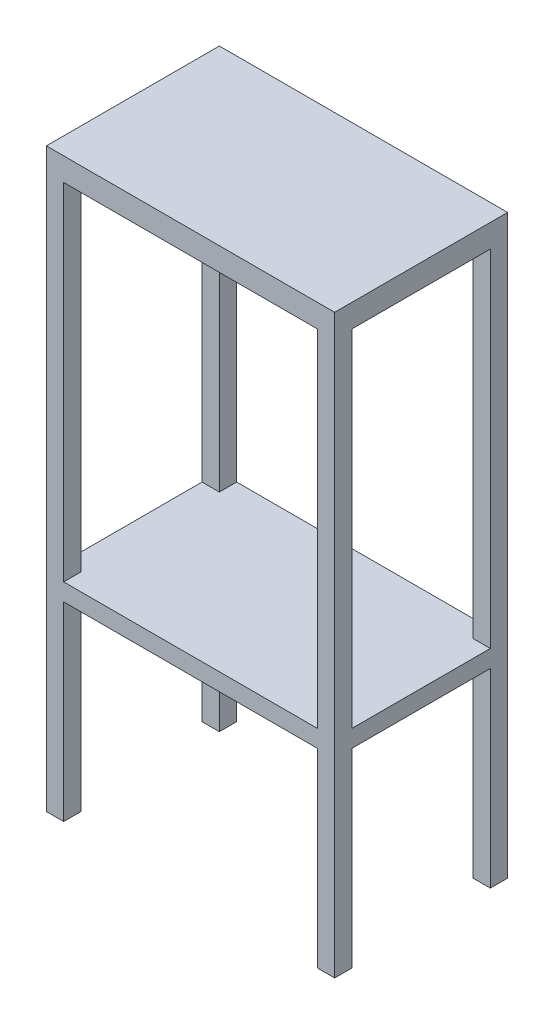
ISO-10303-21;
HEADER;
FILE_DESCRIPTION(('STEP AP214'),'2;1');
FILE_NAME('part.step','',(''),(''),'','','');
FILE_SCHEMA(('AUTOMOTIVE_DESIGN { 1 0 10303 214 1 1 1 1 }'));
ENDSEC;
DATA;
#1=APPLICATION_CONTEXT('core data for automotive mechanical design processes');
#2=APPLICATION_PROTOCOL_DEFINITION('international standard','automotive_design',2000,#1);
#3=PRODUCT_CONTEXT('',#1,'mechanical');
#4=PRODUCT('Part','Part','',(#3));
#5=PRODUCT_RELATED_PRODUCT_CATEGORY('part','',(#4));
#6=PRODUCT_DEFINITION_FORMATION('','',#4);
#7=PRODUCT_DEFINITION_CONTEXT('part definition',#1,'design');
#8=PRODUCT_DEFINITION('design','',#6,#7);
#9=PRODUCT_DEFINITION_SHAPE('','',#8);
#10=(LENGTH_UNIT() NAMED_UNIT(*) SI_UNIT(.MILLI.,.METRE.));
#11=(NAMED_UNIT(*) PLANE_ANGLE_UNIT() SI_UNIT($,.RADIAN.));
#12=(NAMED_UNIT(*) SI_UNIT($,.STERADIAN.) SOLID_ANGLE_UNIT());
#13=UNCERTAINTY_MEASURE_WITH_UNIT(LENGTH_MEASURE(1.E-05),#10,'distance_accuracy_value','');
#14=(GEOMETRIC_REPRESENTATION_CONTEXT(3) GLOBAL_UNCERTAINTY_ASSIGNED_CONTEXT((#13)) GLOBAL_UNIT_ASSIGNED_CONTEXT((#10,
#11,#12)) REPRESENTATION_CONTEXT('',''));
#15=CARTESIAN_POINT('',(0.,0.,0.));
#16=DIRECTION('',(0.,0.,1.));
#17=DIRECTION('',(1.,0.,0.));
#18=AXIS2_PLACEMENT_3D('',#15,#16,#17);
#19=CARTESIAN_POINT('',(250.,1000.,-150.));
#20=DIRECTION('',(-1.,0.,0.));
#21=DIRECTION('',(0.,0.,1.));
#22=AXIS2_PLACEMENT_3D('',#19,#20,#21);
#23=PLANE('',#22);
#24=DIRECTION('',(0.,0.,1.));
#25=VECTOR('',#24,1.);
#26=CARTESIAN_POINT('',(250.,960.,-150.));
#27=LINE('',#26,#25);
#28=CARTESIAN_POINT('',(250.,960.,-120.));
#29=VERTEX_POINT('',#28);
#30=CARTESIAN_POINT('',(250.,960.,120.));
#31=VERTEX_POINT('',#30);
#32=EDGE_CURVE('E306',#29,#31,#27,.T.);
#33=ORIENTED_EDGE('',*,*,#32,.F.);
#34=DIRECTION('',(0.,1.,0.));
#35=VECTOR('',#34,1.);
#36=CARTESIAN_POINT('',(250.,1000.,-120.));
#37=LINE('',#36,#35);
#38=CARTESIAN_POINT('',(250.,360.,-120.));
#39=VERTEX_POINT('',#38);
#40=EDGE_CURVE('E426',#39,#29,#37,.T.);
#41=ORIENTED_EDGE('',*,*,#40,.F.);
#42=DIRECTION('',(0.,0.,-1.));
#43=VECTOR('',#42,1.);
#44=CARTESIAN_POINT('',(250.,360.,-150.));
#45=LINE('',#44,#43);
#46=CARTESIAN_POINT('',(250.,360.,120.));
#47=VERTEX_POINT('',#46);
#48=EDGE_CURVE('E440',#47,#39,#45,.T.);
#49=ORIENTED_EDGE('',*,*,#48,.F.);
#50=DIRECTION('',(0.,-1.,0.));
#51=VECTOR('',#50,1.);
#52=CARTESIAN_POINT('',(250.,1000.,120.));
#53=LINE('',#52,#51);
#54=EDGE_CURVE('E436',#31,#47,#53,.T.);
#55=ORIENTED_EDGE('',*,*,#54,.F.);
#56=EDGE_LOOP('',(#33,#41,#49,#55));
#57=FACE_BOUND('',#56,.T.);
#58=DIRECTION('',(0.,1.,0.));
#59=VECTOR('',#58,1.);
#60=CARTESIAN_POINT('',(250.,1000.,-120.));
#61=LINE('',#60,#59);
#62=CARTESIAN_POINT('',(250.,0.,-120.));
#63=VERTEX_POINT('',#62);
#64=CARTESIAN_POINT('',(250.,330.,-120.));
#65=VERTEX_POINT('',#64);
#66=EDGE_CURVE('E401',#63,#65,#61,.T.);
#67=ORIENTED_EDGE('',*,*,#66,.F.);
#68=DIRECTION('',(0.,0.,-1.));
#69=VECTOR('',#68,1.);
#70=CARTESIAN_POINT('',(250.,0.,-150.));
#71=LINE('',#70,#69);
#72=CARTESIAN_POINT('',(250.,0.,-150.));
#73=VERTEX_POINT('',#72);
#74=EDGE_CURVE('E241',#63,#73,#71,.T.);
#75=ORIENTED_EDGE('',*,*,#74,.T.);
#76=DIRECTION('',(0.,-1.,0.));
#77=VECTOR('',#76,1.);
#78=CARTESIAN_POINT('',(250.,1000.,-150.));
#79=LINE('',#78,#77);
#80=CARTESIAN_POINT('',(250.,1000.,-150.));
#81=VERTEX_POINT('',#80);
#82=EDGE_CURVE('E267',#81,#73,#79,.T.);
#83=ORIENTED_EDGE('',*,*,#82,.F.);
#84=DIRECTION('',(0.,0.,-1.));
#85=VECTOR('',#84,1.);
#86=CARTESIAN_POINT('',(250.,1000.,-150.));
#87=LINE('',#86,#85);
#88=CARTESIAN_POINT('',(250.,1000.,150.));
#89=VERTEX_POINT('',#88);
#90=EDGE_CURVE('E259',#89,#81,#87,.T.);
#91=ORIENTED_EDGE('',*,*,#90,.F.);
#92=DIRECTION('',(0.,-1.,0.));
#93=VECTOR('',#92,1.);
#94=CARTESIAN_POINT('',(250.,1000.,150.));
#95=LINE('',#94,#93);
#96=CARTESIAN_POINT('',(250.,0.,150.));
#97=VERTEX_POINT('',#96);
#98=EDGE_CURVE('E239',#89,#97,#95,.T.);
#99=ORIENTED_EDGE('',*,*,#98,.T.);
#100=CARTESIAN_POINT('',(250.,0.,120.));
#101=VERTEX_POINT('',#100);
#102=EDGE_CURVE('E231',#97,#101,#71,.T.);
#103=ORIENTED_EDGE('',*,*,#102,.T.);
#104=DIRECTION('',(0.,-1.,0.));
#105=VECTOR('',#104,1.);
#106=CARTESIAN_POINT('',(250.,1000.,120.));
#107=LINE('',#106,#105);
#108=CARTESIAN_POINT('',(250.,330.,120.));
#109=VERTEX_POINT('',#108);
#110=EDGE_CURVE('E216',#109,#101,#107,.T.);
#111=ORIENTED_EDGE('',*,*,#110,.F.);
#112=DIRECTION('',(0.,0.,1.));
#113=VECTOR('',#112,1.);
#114=CARTESIAN_POINT('',(250.,330.,-150.));
#115=LINE('',#114,#113);
#116=EDGE_CURVE('E394',#65,#109,#115,.T.);
#117=ORIENTED_EDGE('',*,*,#116,.F.);
#118=EDGE_LOOP('',(#67,#75,#83,#91,#99,#103,#111,#117));
#119=FACE_BOUND('',#118,.T.);
#120=ADVANCED_FACE('F33',(#57,#119),#23,.F.);
#121=CARTESIAN_POINT('',(-250.,1000.,-150.));
#122=DIRECTION('',(1.,0.,0.));
#123=DIRECTION('',(0.,0.,-1.));
#124=AXIS2_PLACEMENT_3D('',#121,#122,#123);
#125=PLANE('',#124);
#126=DIRECTION('',(0.,0.,-1.));
#127=VECTOR('',#126,1.);
#128=CARTESIAN_POINT('',(-250.,960.,-150.));
#129=LINE('',#128,#127);
#130=CARTESIAN_POINT('',(-250.,960.,120.));
#131=VERTEX_POINT('',#130);
#132=CARTESIAN_POINT('',(-250.,960.,-120.));
#133=VERTEX_POINT('',#132);
#134=EDGE_CURVE('E442',#131,#133,#129,.T.);
#135=ORIENTED_EDGE('',*,*,#134,.F.);
#136=DIRECTION('',(0.,1.,0.));
#137=VECTOR('',#136,1.);
#138=CARTESIAN_POINT('',(-250.,1000.,120.));
#139=LINE('',#138,#137);
#140=CARTESIAN_POINT('',(-250.,360.,120.));
#141=VERTEX_POINT('',#140);
#142=EDGE_CURVE('E434',#141,#131,#139,.T.);
#143=ORIENTED_EDGE('',*,*,#142,.F.);
#144=DIRECTION('',(0.,0.,1.));
#145=VECTOR('',#144,1.);
#146=CARTESIAN_POINT('',(-250.,360.,-150.));
#147=LINE('',#146,#145);
#148=CARTESIAN_POINT('',(-250.,360.,-120.));
#149=VERTEX_POINT('',#148);
#150=EDGE_CURVE('E438',#149,#141,#147,.T.);
#151=ORIENTED_EDGE('',*,*,#150,.F.);
#152=DIRECTION('',(0.,-1.,0.));
#153=VECTOR('',#152,1.);
#154=CARTESIAN_POINT('',(-250.,1000.,-120.));
#155=LINE('',#154,#153);
#156=EDGE_CURVE('E424',#133,#149,#155,.T.);
#157=ORIENTED_EDGE('',*,*,#156,.F.);
#158=EDGE_LOOP('',(#135,#143,#151,#157));
#159=FACE_BOUND('',#158,.T.);
#160=DIRECTION('',(0.,-1.,0.));
#161=VECTOR('',#160,1.);
#162=CARTESIAN_POINT('',(-250.,1000.,-120.));
#163=LINE('',#162,#161);
#164=CARTESIAN_POINT('',(-250.,330.,-120.));
#165=VERTEX_POINT('',#164);
#166=CARTESIAN_POINT('',(-250.,0.,-120.));
#167=VERTEX_POINT('',#166);
#168=EDGE_CURVE('E399',#165,#167,#163,.T.);
#169=ORIENTED_EDGE('',*,*,#168,.F.);
#170=DIRECTION('',(0.,0.,-1.));
#171=VECTOR('',#170,1.);
#172=CARTESIAN_POINT('',(-250.,330.,-150.));
#173=LINE('',#172,#171);
#174=CARTESIAN_POINT('',(-250.,330.,120.));
#175=VERTEX_POINT('',#174);
#176=EDGE_CURVE('E223',#175,#165,#173,.T.);
#177=ORIENTED_EDGE('',*,*,#176,.F.);
#178=DIRECTION('',(0.,1.,0.));
#179=VECTOR('',#178,1.);
#180=CARTESIAN_POINT('',(-250.,1000.,120.));
#181=LINE('',#180,#179);
#182=CARTESIAN_POINT('',(-250.,0.,120.));
#183=VERTEX_POINT('',#182);
#184=EDGE_CURVE('E224',#183,#175,#181,.T.);
#185=ORIENTED_EDGE('',*,*,#184,.F.);
#186=DIRECTION('',(0.,0.,1.));
#187=VECTOR('',#186,1.);
#188=CARTESIAN_POINT('',(-250.,0.,-150.));
#189=LINE('',#188,#187);
#190=CARTESIAN_POINT('',(-250.,0.,150.));
#191=VERTEX_POINT('',#190);
#192=EDGE_CURVE('E251',#183,#191,#189,.T.);
#193=ORIENTED_EDGE('',*,*,#192,.T.);
#194=DIRECTION('',(0.,-1.,0.));
#195=VECTOR('',#194,1.);
#196=CARTESIAN_POINT('',(-250.,1000.,150.));
#197=LINE('',#196,#195);
#198=CARTESIAN_POINT('',(-250.,1000.,150.));
#199=VERTEX_POINT('',#198);
#200=EDGE_CURVE('E261',#199,#191,#197,.T.);
#201=ORIENTED_EDGE('',*,*,#200,.F.);
#202=DIRECTION('',(0.,0.,1.));
#203=VECTOR('',#202,1.);
#204=CARTESIAN_POINT('',(-250.,1000.,-150.));
#205=LINE('',#204,#203);
#206=CARTESIAN_POINT('',(-250.,1000.,-150.));
#207=VERTEX_POINT('',#206);
#208=EDGE_CURVE('E353',#207,#199,#205,.T.);
#209=ORIENTED_EDGE('',*,*,#208,.F.);
#210=DIRECTION('',(0.,-1.,0.));
#211=VECTOR('',#210,1.);
#212=CARTESIAN_POINT('',(-250.,1000.,-150.));
#213=LINE('',#212,#211);
#214=CARTESIAN_POINT('',(-250.,0.,-150.));
#215=VERTEX_POINT('',#214);
#216=EDGE_CURVE('E264',#207,#215,#213,.T.);
#217=ORIENTED_EDGE('',*,*,#216,.T.);
#218=EDGE_CURVE('E252',#215,#167,#189,.T.);
#219=ORIENTED_EDGE('',*,*,#218,.T.);
#220=EDGE_LOOP('',(#169,#177,#185,#193,#201,#209,#217,#219));
#221=FACE_BOUND('',#220,.T.);
#222=ADVANCED_FACE('F374',(#159,#221),#125,.F.);
#223=CARTESIAN_POINT('',(250.,0.,150.));
#224=DIRECTION('',(0.,1.,0.));
#225=DIRECTION('',(0.,0.,1.));
#226=AXIS2_PLACEMENT_3D('',#223,#224,#225);
#227=PLANE('',#226);
#228=DIRECTION('',(-1.,0.,0.));
#229=VECTOR('',#228,1.);
#230=CARTESIAN_POINT('',(1000.,0.,-120.));
#231=LINE('',#230,#229);
#232=CARTESIAN_POINT('',(220.,0.,-120.));
#233=VERTEX_POINT('',#232);
#234=EDGE_CURVE('E380',#63,#233,#231,.T.);
#235=ORIENTED_EDGE('',*,*,#234,.T.);
#236=DIRECTION('',(0.,0.,1.));
#237=VECTOR('',#236,1.);
#238=CARTESIAN_POINT('',(220.,0.,150.));
#239=LINE('',#238,#237);
#240=CARTESIAN_POINT('',(220.,0.,-150.));
#241=VERTEX_POINT('',#240);
#242=EDGE_CURVE('E283',#241,#233,#239,.T.);
#243=ORIENTED_EDGE('',*,*,#242,.F.);
#244=DIRECTION('',(-1.,0.,0.));
#245=VECTOR('',#244,1.);
#246=CARTESIAN_POINT('',(-250.,0.,-150.));
#247=LINE('',#246,#245);
#248=EDGE_CURVE('E243',#73,#241,#247,.T.);
#249=ORIENTED_EDGE('',*,*,#248,.F.);
#250=ORIENTED_EDGE('',*,*,#74,.F.);
#251=EDGE_LOOP('',(#235,#243,#249,#250));
#252=FACE_BOUND('',#251,.T.);
#253=ADVANCED_FACE('F514',(#252),#227,.F.);
#254=DIRECTION('',(-1.,0.,0.));
#255=VECTOR('',#254,1.);
#256=CARTESIAN_POINT('',(1000.,0.,120.));
#257=LINE('',#256,#255);
#258=CARTESIAN_POINT('',(220.,0.,120.));
#259=VERTEX_POINT('',#258);
#260=EDGE_CURVE('E47',#101,#259,#257,.T.);
#261=ORIENTED_EDGE('',*,*,#260,.F.);
#262=ORIENTED_EDGE('',*,*,#102,.F.);
#263=DIRECTION('',(1.,0.,0.));
#264=VECTOR('',#263,1.);
#265=CARTESIAN_POINT('',(-250.,0.,150.));
#266=LINE('',#265,#264);
#267=CARTESIAN_POINT('',(220.,0.,150.));
#268=VERTEX_POINT('',#267);
#269=EDGE_CURVE('E255',#268,#97,#266,.T.);
#270=ORIENTED_EDGE('',*,*,#269,.F.);
#271=EDGE_CURVE('E232',#259,#268,#239,.T.);
#272=ORIENTED_EDGE('',*,*,#271,.F.);
#273=EDGE_LOOP('',(#261,#262,#270,#272));
#274=FACE_BOUND('',#273,.T.);
#275=ADVANCED_FACE('F229',(#274),#227,.F.);
#276=CARTESIAN_POINT('',(-220.,0.,-120.));
#277=VERTEX_POINT('',#276);
#278=EDGE_CURVE('E382',#277,#167,#231,.T.);
#279=ORIENTED_EDGE('',*,*,#278,.T.);
#280=ORIENTED_EDGE('',*,*,#218,.F.);
#281=CARTESIAN_POINT('',(-220.,0.,-150.));
#282=VERTEX_POINT('',#281);
#283=EDGE_CURVE('E240',#282,#215,#247,.T.);
#284=ORIENTED_EDGE('',*,*,#283,.F.);
#285=DIRECTION('',(0.,0.,-1.));
#286=VECTOR('',#285,1.);
#287=CARTESIAN_POINT('',(-220.,0.,150.));
#288=LINE('',#287,#286);
#289=EDGE_CURVE('E279',#277,#282,#288,.T.);
#290=ORIENTED_EDGE('',*,*,#289,.F.);
#291=EDGE_LOOP('',(#279,#280,#284,#290));
#292=FACE_BOUND('',#291,.T.);
#293=ADVANCED_FACE('F601',(#292),#227,.F.);
#294=CARTESIAN_POINT('',(-220.,0.,120.));
#295=VERTEX_POINT('',#294);
#296=EDGE_CURVE('E233',#295,#183,#257,.T.);
#297=ORIENTED_EDGE('',*,*,#296,.F.);
#298=CARTESIAN_POINT('',(-220.,0.,150.));
#299=VERTEX_POINT('',#298);
#300=EDGE_CURVE('E280',#299,#295,#288,.T.);
#301=ORIENTED_EDGE('',*,*,#300,.F.);
#302=EDGE_CURVE('E256',#191,#299,#266,.T.);
#303=ORIENTED_EDGE('',*,*,#302,.F.);
#304=ORIENTED_EDGE('',*,*,#192,.F.);
#305=EDGE_LOOP('',(#297,#301,#303,#304));
#306=FACE_BOUND('',#305,.T.);
#307=ADVANCED_FACE('F379',(#306),#227,.F.);
#308=CARTESIAN_POINT('',(220.,330.,1000.));
#309=DIRECTION('',(-1.,0.,0.));
#310=DIRECTION('',(0.,0.,1.));
#311=AXIS2_PLACEMENT_3D('',#308,#309,#310);
#312=PLANE('',#311);
#313=ORIENTED_EDGE('',*,*,#242,.T.);
#314=DIRECTION('',(0.,1.,0.));
#315=VECTOR('',#314,1.);
#316=CARTESIAN_POINT('',(220.,330.,-120.));
#317=LINE('',#316,#315);
#318=CARTESIAN_POINT('',(220.,330.,-120.));
#319=VERTEX_POINT('',#318);
#320=EDGE_CURVE('E396',#233,#319,#317,.T.);
#321=ORIENTED_EDGE('',*,*,#320,.T.);
#322=DIRECTION('',(0.,0.,-1.));
#323=VECTOR('',#322,1.);
#324=CARTESIAN_POINT('',(220.,330.,1000.));
#325=LINE('',#324,#323);
#326=CARTESIAN_POINT('',(220.,330.,-150.));
#327=VERTEX_POINT('',#326);
#328=EDGE_CURVE('E301',#319,#327,#325,.T.);
#329=ORIENTED_EDGE('',*,*,#328,.T.);
#330=DIRECTION('',(0.,-1.,0.));
#331=VECTOR('',#330,1.);
#332=CARTESIAN_POINT('',(220.,1000.,-150.));
#333=LINE('',#332,#331);
#334=EDGE_CURVE('E318',#327,#241,#333,.T.);
#335=ORIENTED_EDGE('',*,*,#334,.T.);
#336=EDGE_LOOP('',(#313,#321,#329,#335));
#337=FACE_BOUND('',#336,.T.);
#338=ADVANCED_FACE('F617',(#337),#312,.T.);
#339=CARTESIAN_POINT('',(220.,330.,150.));
#340=VERTEX_POINT('',#339);
#341=CARTESIAN_POINT('',(220.,330.,120.));
#342=VERTEX_POINT('',#341);
#343=EDGE_CURVE('E304',#340,#342,#325,.T.);
#344=ORIENTED_EDGE('',*,*,#343,.T.);
#345=DIRECTION('',(0.,-1.,0.));
#346=VECTOR('',#345,1.);
#347=CARTESIAN_POINT('',(220.,330.,120.));
#348=LINE('',#347,#346);
#349=EDGE_CURVE('E390',#342,#259,#348,.T.);
#350=ORIENTED_EDGE('',*,*,#349,.T.);
#351=ORIENTED_EDGE('',*,*,#271,.T.);
#352=DIRECTION('',(0.,1.,0.));
#353=VECTOR('',#352,1.);
#354=CARTESIAN_POINT('',(220.,1000.,150.));
#355=LINE('',#354,#353);
#356=EDGE_CURVE('E316',#268,#340,#355,.T.);
#357=ORIENTED_EDGE('',*,*,#356,.T.);
#358=EDGE_LOOP('',(#344,#350,#351,#357));
#359=FACE_BOUND('',#358,.T.);
#360=ADVANCED_FACE('F625',(#359),#312,.T.);
#361=CARTESIAN_POINT('',(-220.,330.,1000.));
#362=DIRECTION('',(1.,0.,0.));
#363=DIRECTION('',(0.,0.,-1.));
#364=AXIS2_PLACEMENT_3D('',#361,#362,#363);
#365=PLANE('',#364);
#366=DIRECTION('',(0.,0.,-1.));
#367=VECTOR('',#366,1.);
#368=CARTESIAN_POINT('',(-220.,330.,1000.));
#369=LINE('',#368,#367);
#370=CARTESIAN_POINT('',(-220.,330.,-120.));
#371=VERTEX_POINT('',#370);
#372=CARTESIAN_POINT('',(-220.,330.,-150.));
#373=VERTEX_POINT('',#372);
#374=EDGE_CURVE('E302',#371,#373,#369,.T.);
#375=ORIENTED_EDGE('',*,*,#374,.F.);
#376=DIRECTION('',(0.,-1.,0.));
#377=VECTOR('',#376,1.);
#378=CARTESIAN_POINT('',(-220.,330.,-120.));
#379=LINE('',#378,#377);
#380=EDGE_CURVE('E11',#371,#277,#379,.T.);
#381=ORIENTED_EDGE('',*,*,#380,.T.);
#382=ORIENTED_EDGE('',*,*,#289,.T.);
#383=DIRECTION('',(0.,1.,0.));
#384=VECTOR('',#383,1.);
#385=CARTESIAN_POINT('',(-220.,1000.,-150.));
#386=LINE('',#385,#384);
#387=EDGE_CURVE('E313',#282,#373,#386,.T.);
#388=ORIENTED_EDGE('',*,*,#387,.T.);
#389=EDGE_LOOP('',(#375,#381,#382,#388));
#390=FACE_BOUND('',#389,.T.);
#391=ADVANCED_FACE('F634',(#390),#365,.T.);
#392=ORIENTED_EDGE('',*,*,#300,.T.);
#393=DIRECTION('',(0.,1.,0.));
#394=VECTOR('',#393,1.);
#395=CARTESIAN_POINT('',(-220.,330.,120.));
#396=LINE('',#395,#394);
#397=CARTESIAN_POINT('',(-220.,330.,120.));
#398=VERTEX_POINT('',#397);
#399=EDGE_CURVE('E40',#295,#398,#396,.T.);
#400=ORIENTED_EDGE('',*,*,#399,.T.);
#401=CARTESIAN_POINT('',(-220.,330.,150.));
#402=VERTEX_POINT('',#401);
#403=EDGE_CURVE('E291',#402,#398,#369,.T.);
#404=ORIENTED_EDGE('',*,*,#403,.F.);
#405=DIRECTION('',(0.,-1.,0.));
#406=VECTOR('',#405,1.);
#407=CARTESIAN_POINT('',(-220.,1000.,150.));
#408=LINE('',#407,#406);
#409=EDGE_CURVE('E311',#402,#299,#408,.T.);
#410=ORIENTED_EDGE('',*,*,#409,.T.);
#411=EDGE_LOOP('',(#392,#400,#404,#410));
#412=FACE_BOUND('',#411,.T.);
#413=ADVANCED_FACE('F290',(#412),#365,.T.);
#414=CARTESIAN_POINT('',(220.,960.,1000.));
#415=DIRECTION('',(-1.,0.,0.));
#416=DIRECTION('',(0.,-1.,0.));
#417=AXIS2_PLACEMENT_3D('',#414,#415,#416);
#418=PLANE('',#417);
#419=DIRECTION('',(0.,0.,-1.));
#420=VECTOR('',#419,1.);
#421=CARTESIAN_POINT('',(220.,960.,1000.));
#422=LINE('',#421,#420);
#423=CARTESIAN_POINT('',(220.,960.,150.));
#424=VERTEX_POINT('',#423);
#425=CARTESIAN_POINT('',(220.,960.,120.));
#426=VERTEX_POINT('',#425);
#427=EDGE_CURVE('E336',#424,#426,#422,.T.);
#428=ORIENTED_EDGE('',*,*,#427,.T.);
#429=DIRECTION('',(0.,-1.,0.));
#430=VECTOR('',#429,1.);
#431=CARTESIAN_POINT('',(220.,960.,120.));
#432=LINE('',#431,#430);
#433=CARTESIAN_POINT('',(220.,360.,120.));
#434=VERTEX_POINT('',#433);
#435=EDGE_CURVE('E431',#426,#434,#432,.T.);
#436=ORIENTED_EDGE('',*,*,#435,.T.);
#437=DIRECTION('',(0.,0.,-1.));
#438=VECTOR('',#437,1.);
#439=CARTESIAN_POINT('',(220.,360.,1000.));
#440=LINE('',#439,#438);
#441=CARTESIAN_POINT('',(220.,360.,150.));
#442=VERTEX_POINT('',#441);
#443=EDGE_CURVE('E324',#442,#434,#440,.T.);
#444=ORIENTED_EDGE('',*,*,#443,.F.);
#445=DIRECTION('',(0.,1.,0.));
#446=VECTOR('',#445,1.);
#447=CARTESIAN_POINT('',(220.,1000.,150.));
#448=LINE('',#447,#446);
#449=EDGE_CURVE('E277',#442,#424,#448,.T.);
#450=ORIENTED_EDGE('',*,*,#449,.T.);
#451=EDGE_LOOP('',(#428,#436,#444,#450));
#452=FACE_BOUND('',#451,.T.);
#453=ADVANCED_FACE('F469',(#452),#418,.T.);
#454=CARTESIAN_POINT('',(220.,360.,-120.));
#455=VERTEX_POINT('',#454);
#456=CARTESIAN_POINT('',(220.,360.,-150.));
#457=VERTEX_POINT('',#456);
#458=EDGE_CURVE('E323',#455,#457,#440,.T.);
#459=ORIENTED_EDGE('',*,*,#458,.F.);
#460=DIRECTION('',(0.,1.,0.));
#461=VECTOR('',#460,1.);
#462=CARTESIAN_POINT('',(220.,960.,-120.));
#463=LINE('',#462,#461);
#464=CARTESIAN_POINT('',(220.,960.,-120.));
#465=VERTEX_POINT('',#464);
#466=EDGE_CURVE('E421',#455,#465,#463,.T.);
#467=ORIENTED_EDGE('',*,*,#466,.T.);
#468=CARTESIAN_POINT('',(220.,960.,-150.));
#469=VERTEX_POINT('',#468);
#470=EDGE_CURVE('E335',#465,#469,#422,.T.);
#471=ORIENTED_EDGE('',*,*,#470,.T.);
#472=DIRECTION('',(0.,-1.,0.));
#473=VECTOR('',#472,1.);
#474=CARTESIAN_POINT('',(220.,1000.,-150.));
#475=LINE('',#474,#473);
#476=EDGE_CURVE('E245',#469,#457,#475,.T.);
#477=ORIENTED_EDGE('',*,*,#476,.T.);
#478=EDGE_LOOP('',(#459,#467,#471,#477));
#479=FACE_BOUND('',#478,.T.);
#480=ADVANCED_FACE('F494',(#479),#418,.T.);
#481=CARTESIAN_POINT('',(-220.,960.,1000.));
#482=DIRECTION('',(1.,0.,0.));
#483=DIRECTION('',(0.,1.,0.));
#484=AXIS2_PLACEMENT_3D('',#481,#482,#483);
#485=PLANE('',#484);
#486=DIRECTION('',(0.,0.,-1.));
#487=VECTOR('',#486,1.);
#488=CARTESIAN_POINT('',(-220.,360.,1000.));
#489=LINE('',#488,#487);
#490=CARTESIAN_POINT('',(-220.,360.,150.));
#491=VERTEX_POINT('',#490);
#492=CARTESIAN_POINT('',(-220.,360.,120.));
#493=VERTEX_POINT('',#492);
#494=EDGE_CURVE('E328',#491,#493,#489,.T.);
#495=ORIENTED_EDGE('',*,*,#494,.T.);
#496=DIRECTION('',(0.,1.,0.));
#497=VECTOR('',#496,1.);
#498=CARTESIAN_POINT('',(-220.,960.,120.));
#499=LINE('',#498,#497);
#500=CARTESIAN_POINT('',(-220.,960.,120.));
#501=VERTEX_POINT('',#500);
#502=EDGE_CURVE('E428',#493,#501,#499,.T.);
#503=ORIENTED_EDGE('',*,*,#502,.T.);
#504=DIRECTION('',(0.,0.,-1.));
#505=VECTOR('',#504,1.);
#506=CARTESIAN_POINT('',(-220.,960.,1000.));
#507=LINE('',#506,#505);
#508=CARTESIAN_POINT('',(-220.,960.,150.));
#509=VERTEX_POINT('',#508);
#510=EDGE_CURVE('E332',#509,#501,#507,.T.);
#511=ORIENTED_EDGE('',*,*,#510,.F.);
#512=DIRECTION('',(0.,-1.,0.));
#513=VECTOR('',#512,1.);
#514=CARTESIAN_POINT('',(-220.,1000.,150.));
#515=LINE('',#514,#513);
#516=EDGE_CURVE('E272',#509,#491,#515,.T.);
#517=ORIENTED_EDGE('',*,*,#516,.T.);
#518=EDGE_LOOP('',(#495,#503,#511,#517));
#519=FACE_BOUND('',#518,.T.);
#520=ADVANCED_FACE('F477',(#519),#485,.T.);
#521=CARTESIAN_POINT('',(-220.,960.,-120.));
#522=VERTEX_POINT('',#521);
#523=CARTESIAN_POINT('',(-220.,960.,-150.));
#524=VERTEX_POINT('',#523);
#525=EDGE_CURVE('E331',#522,#524,#507,.T.);
#526=ORIENTED_EDGE('',*,*,#525,.F.);
#527=DIRECTION('',(0.,-1.,0.));
#528=VECTOR('',#527,1.);
#529=CARTESIAN_POINT('',(-220.,960.,-120.));
#530=LINE('',#529,#528);
#531=CARTESIAN_POINT('',(-220.,360.,-120.));
#532=VERTEX_POINT('',#531);
#533=EDGE_CURVE('E418',#522,#532,#530,.T.);
#534=ORIENTED_EDGE('',*,*,#533,.T.);
#535=CARTESIAN_POINT('',(-220.,360.,-150.));
#536=VERTEX_POINT('',#535);
#537=EDGE_CURVE('E327',#532,#536,#489,.T.);
#538=ORIENTED_EDGE('',*,*,#537,.T.);
#539=DIRECTION('',(0.,1.,0.));
#540=VECTOR('',#539,1.);
#541=CARTESIAN_POINT('',(-220.,1000.,-150.));
#542=LINE('',#541,#540);
#543=EDGE_CURVE('E342',#536,#524,#542,.T.);
#544=ORIENTED_EDGE('',*,*,#543,.T.);
#545=EDGE_LOOP('',(#526,#534,#538,#544));
#546=FACE_BOUND('',#545,.T.);
#547=ADVANCED_FACE('F489',(#546),#485,.T.);
#548=CARTESIAN_POINT('',(-250.,1000.,-150.));
#549=DIRECTION('',(0.,0.,1.));
#550=DIRECTION('',(1.,0.,0.));
#551=AXIS2_PLACEMENT_3D('',#548,#549,#550);
#552=PLANE('',#551);
#553=ORIENTED_EDGE('',*,*,#476,.F.);
#554=DIRECTION('',(1.,0.,0.));
#555=VECTOR('',#554,1.);
#556=CARTESIAN_POINT('',(-250.,960.,-150.));
#557=LINE('',#556,#555);
#558=EDGE_CURVE('E345',#524,#469,#557,.T.);
#559=ORIENTED_EDGE('',*,*,#558,.F.);
#560=ORIENTED_EDGE('',*,*,#543,.F.);
#561=DIRECTION('',(-1.,0.,0.));
#562=VECTOR('',#561,1.);
#563=CARTESIAN_POINT('',(-250.,360.,-150.));
#564=LINE('',#563,#562);
#565=EDGE_CURVE('E339',#457,#536,#564,.T.);
#566=ORIENTED_EDGE('',*,*,#565,.F.);
#567=EDGE_LOOP('',(#553,#559,#560,#566));
#568=FACE_BOUND('',#567,.T.);
#569=ORIENTED_EDGE('',*,*,#334,.F.);
#570=DIRECTION('',(1.,0.,0.));
#571=VECTOR('',#570,1.);
#572=CARTESIAN_POINT('',(-250.,330.,-150.));
#573=LINE('',#572,#571);
#574=EDGE_CURVE('E320',#373,#327,#573,.T.);
#575=ORIENTED_EDGE('',*,*,#574,.F.);
#576=ORIENTED_EDGE('',*,*,#387,.F.);
#577=ORIENTED_EDGE('',*,*,#283,.T.);
#578=ORIENTED_EDGE('',*,*,#216,.F.);
#579=DIRECTION('',(-1.,0.,0.));
#580=VECTOR('',#579,1.);
#581=CARTESIAN_POINT('',(-250.,1000.,-150.));
#582=LINE('',#581,#580);
#583=EDGE_CURVE('E352',#81,#207,#582,.T.);
#584=ORIENTED_EDGE('',*,*,#583,.F.);
#585=ORIENTED_EDGE('',*,*,#82,.T.);
#586=ORIENTED_EDGE('',*,*,#248,.T.);
#587=EDGE_LOOP('',(#569,#575,#576,#577,#578,#584,#585,#586));
#588=FACE_BOUND('',#587,.T.);
#589=ADVANCED_FACE('F367',(#568,#588),#552,.F.);
#590=CARTESIAN_POINT('',(-250.,1000.,150.));
#591=DIRECTION('',(0.,0.,-1.));
#592=DIRECTION('',(-1.,0.,0.));
#593=AXIS2_PLACEMENT_3D('',#590,#591,#592);
#594=PLANE('',#593);
#595=ORIENTED_EDGE('',*,*,#449,.F.);
#596=DIRECTION('',(1.,0.,0.));
#597=VECTOR('',#596,1.);
#598=CARTESIAN_POINT('',(-250.,360.,150.));
#599=LINE('',#598,#597);
#600=EDGE_CURVE('E270',#491,#442,#599,.T.);
#601=ORIENTED_EDGE('',*,*,#600,.F.);
#602=ORIENTED_EDGE('',*,*,#516,.F.);
#603=DIRECTION('',(-1.,0.,0.));
#604=VECTOR('',#603,1.);
#605=CARTESIAN_POINT('',(-250.,960.,150.));
#606=LINE('',#605,#604);
#607=EDGE_CURVE('E275',#424,#509,#606,.T.);
#608=ORIENTED_EDGE('',*,*,#607,.F.);
#609=EDGE_LOOP('',(#595,#601,#602,#608));
#610=FACE_BOUND('',#609,.T.);
#611=ORIENTED_EDGE('',*,*,#356,.F.);
#612=ORIENTED_EDGE('',*,*,#269,.T.);
#613=ORIENTED_EDGE('',*,*,#98,.F.);
#614=DIRECTION('',(1.,0.,0.));
#615=VECTOR('',#614,1.);
#616=CARTESIAN_POINT('',(-250.,1000.,150.));
#617=LINE('',#616,#615);
#618=EDGE_CURVE('E247',#199,#89,#617,.T.);
#619=ORIENTED_EDGE('',*,*,#618,.F.);
#620=ORIENTED_EDGE('',*,*,#200,.T.);
#621=ORIENTED_EDGE('',*,*,#302,.T.);
#622=ORIENTED_EDGE('',*,*,#409,.F.);
#623=DIRECTION('',(-1.,0.,0.));
#624=VECTOR('',#623,1.);
#625=CARTESIAN_POINT('',(-250.,330.,150.));
#626=LINE('',#625,#624);
#627=EDGE_CURVE('E286',#340,#402,#626,.T.);
#628=ORIENTED_EDGE('',*,*,#627,.F.);
#629=EDGE_LOOP('',(#611,#612,#613,#619,#620,#621,#622,#628));
#630=FACE_BOUND('',#629,.T.);
#631=ADVANCED_FACE('F362',(#610,#630),#594,.F.);
#632=CARTESIAN_POINT('',(250.,1000.,150.));
#633=DIRECTION('',(0.,1.,0.));
#634=DIRECTION('',(0.,0.,1.));
#635=AXIS2_PLACEMENT_3D('',#632,#633,#634);
#636=PLANE('',#635);
#637=ORIENTED_EDGE('',*,*,#90,.T.);
#638=ORIENTED_EDGE('',*,*,#583,.T.);
#639=ORIENTED_EDGE('',*,*,#208,.T.);
#640=ORIENTED_EDGE('',*,*,#618,.T.);
#641=EDGE_LOOP('',(#637,#638,#639,#640));
#642=FACE_BOUND('',#641,.T.);
#643=ADVANCED_FACE('F358',(#642),#636,.T.);
#644=CARTESIAN_POINT('',(-220.,960.,1000.));
#645=DIRECTION('',(0.,-1.,0.));
#646=DIRECTION('',(0.,0.,-1.));
#647=AXIS2_PLACEMENT_3D('',#644,#645,#646);
#648=PLANE('',#647);
#649=ORIENTED_EDGE('',*,*,#470,.F.);
#650=DIRECTION('',(-1.,0.,0.));
#651=VECTOR('',#650,1.);
#652=CARTESIAN_POINT('',(1000.,960.,-120.));
#653=LINE('',#652,#651);
#654=EDGE_CURVE('E405',#29,#465,#653,.T.);
#655=ORIENTED_EDGE('',*,*,#654,.F.);
#656=ORIENTED_EDGE('',*,*,#32,.T.);
#657=DIRECTION('',(-1.,0.,0.));
#658=VECTOR('',#657,1.);
#659=CARTESIAN_POINT('',(1000.,960.,120.));
#660=LINE('',#659,#658);
#661=EDGE_CURVE('E417',#31,#426,#660,.T.);
#662=ORIENTED_EDGE('',*,*,#661,.T.);
#663=ORIENTED_EDGE('',*,*,#427,.F.);
#664=ORIENTED_EDGE('',*,*,#607,.T.);
#665=ORIENTED_EDGE('',*,*,#510,.T.);
#666=EDGE_CURVE('E414',#501,#131,#660,.T.);
#667=ORIENTED_EDGE('',*,*,#666,.T.);
#668=ORIENTED_EDGE('',*,*,#134,.T.);
#669=EDGE_CURVE('E403',#522,#133,#653,.T.);
#670=ORIENTED_EDGE('',*,*,#669,.F.);
#671=ORIENTED_EDGE('',*,*,#525,.T.);
#672=ORIENTED_EDGE('',*,*,#558,.T.);
#673=EDGE_LOOP('',(#649,#655,#656,#662,#663,#664,#665,#667,#668,#670,#671,#672));
#674=FACE_BOUND('',#673,.T.);
#675=ADVANCED_FACE('F453',(#674),#648,.T.);
#676=CARTESIAN_POINT('',(-220.,360.,1000.));
#677=DIRECTION('',(0.,1.,0.));
#678=DIRECTION('',(0.,0.,1.));
#679=AXIS2_PLACEMENT_3D('',#676,#677,#678);
#680=PLANE('',#679);
#681=ORIENTED_EDGE('',*,*,#537,.F.);
#682=DIRECTION('',(-1.,0.,0.));
#683=VECTOR('',#682,1.);
#684=CARTESIAN_POINT('',(1000.,360.,-120.));
#685=LINE('',#684,#683);
#686=EDGE_CURVE('E406',#532,#149,#685,.T.);
#687=ORIENTED_EDGE('',*,*,#686,.T.);
#688=ORIENTED_EDGE('',*,*,#150,.T.);
#689=DIRECTION('',(-1.,0.,0.));
#690=VECTOR('',#689,1.);
#691=CARTESIAN_POINT('',(1000.,360.,120.));
#692=LINE('',#691,#690);
#693=EDGE_CURVE('E410',#493,#141,#692,.T.);
#694=ORIENTED_EDGE('',*,*,#693,.F.);
#695=ORIENTED_EDGE('',*,*,#494,.F.);
#696=ORIENTED_EDGE('',*,*,#600,.T.);
#697=ORIENTED_EDGE('',*,*,#443,.T.);
#698=EDGE_CURVE('E413',#47,#434,#692,.T.);
#699=ORIENTED_EDGE('',*,*,#698,.F.);
#700=ORIENTED_EDGE('',*,*,#48,.T.);
#701=EDGE_CURVE('E409',#39,#455,#685,.T.);
#702=ORIENTED_EDGE('',*,*,#701,.T.);
#703=ORIENTED_EDGE('',*,*,#458,.T.);
#704=ORIENTED_EDGE('',*,*,#565,.T.);
#705=EDGE_LOOP('',(#681,#687,#688,#694,#695,#696,#697,#699,#700,#702,#703,#704));
#706=FACE_BOUND('',#705,.T.);
#707=ADVANCED_FACE('F465',(#706),#680,.T.);
#708=CARTESIAN_POINT('',(220.,330.,1000.));
#709=DIRECTION('',(0.,-1.,0.));
#710=DIRECTION('',(0.,0.,-1.));
#711=AXIS2_PLACEMENT_3D('',#708,#709,#710);
#712=PLANE('',#711);
#713=DIRECTION('',(-1.,0.,0.));
#714=VECTOR('',#713,1.);
#715=CARTESIAN_POINT('',(1000.,330.,-120.));
#716=LINE('',#715,#714);
#717=EDGE_CURVE('E386',#371,#165,#716,.T.);
#718=ORIENTED_EDGE('',*,*,#717,.F.);
#719=ORIENTED_EDGE('',*,*,#374,.T.);
#720=ORIENTED_EDGE('',*,*,#574,.T.);
#721=ORIENTED_EDGE('',*,*,#328,.F.);
#722=EDGE_CURVE('E389',#65,#319,#716,.T.);
#723=ORIENTED_EDGE('',*,*,#722,.F.);
#724=ORIENTED_EDGE('',*,*,#116,.T.);
#725=DIRECTION('',(-1.,0.,0.));
#726=VECTOR('',#725,1.);
#727=CARTESIAN_POINT('',(1000.,330.,120.));
#728=LINE('',#727,#726);
#729=EDGE_CURVE('E219',#109,#342,#728,.T.);
#730=ORIENTED_EDGE('',*,*,#729,.T.);
#731=ORIENTED_EDGE('',*,*,#343,.F.);
#732=ORIENTED_EDGE('',*,*,#627,.T.);
#733=ORIENTED_EDGE('',*,*,#403,.T.);
#734=EDGE_CURVE('E55',#398,#175,#728,.T.);
#735=ORIENTED_EDGE('',*,*,#734,.T.);
#736=ORIENTED_EDGE('',*,*,#176,.T.);
#737=EDGE_LOOP('',(#718,#719,#720,#721,#723,#724,#730,#731,#732,#733,#735,#736));
#738=FACE_BOUND('',#737,.T.);
#739=ADVANCED_FACE('F297',(#738),#712,.T.);
#740=CARTESIAN_POINT('',(1000.,960.,-120.));
#741=DIRECTION('',(0.,0.,1.));
#742=DIRECTION('',(1.,0.,0.));
#743=AXIS2_PLACEMENT_3D('',#740,#741,#742);
#744=PLANE('',#743);
#745=ORIENTED_EDGE('',*,*,#156,.T.);
#746=ORIENTED_EDGE('',*,*,#686,.F.);
#747=ORIENTED_EDGE('',*,*,#533,.F.);
#748=ORIENTED_EDGE('',*,*,#669,.T.);
#749=EDGE_LOOP('',(#745,#746,#747,#748));
#750=FACE_BOUND('',#749,.T.);
#751=ADVANCED_FACE('F483',(#750),#744,.T.);
#752=CARTESIAN_POINT('',(1000.,960.,120.));
#753=DIRECTION('',(0.,0.,-1.));
#754=DIRECTION('',(0.,1.,0.));
#755=AXIS2_PLACEMENT_3D('',#752,#753,#754);
#756=PLANE('',#755);
#757=ORIENTED_EDGE('',*,*,#142,.T.);
#758=ORIENTED_EDGE('',*,*,#666,.F.);
#759=ORIENTED_EDGE('',*,*,#502,.F.);
#760=ORIENTED_EDGE('',*,*,#693,.T.);
#761=EDGE_LOOP('',(#757,#758,#759,#760));
#762=FACE_BOUND('',#761,.T.);
#763=ADVANCED_FACE('F506',(#762),#756,.T.);
#764=ORIENTED_EDGE('',*,*,#54,.T.);
#765=ORIENTED_EDGE('',*,*,#698,.T.);
#766=ORIENTED_EDGE('',*,*,#435,.F.);
#767=ORIENTED_EDGE('',*,*,#661,.F.);
#768=EDGE_LOOP('',(#764,#765,#766,#767));
#769=FACE_BOUND('',#768,.T.);
#770=ADVANCED_FACE('F459',(#769),#756,.T.);
#771=ORIENTED_EDGE('',*,*,#40,.T.);
#772=ORIENTED_EDGE('',*,*,#654,.T.);
#773=ORIENTED_EDGE('',*,*,#466,.F.);
#774=ORIENTED_EDGE('',*,*,#701,.F.);
#775=EDGE_LOOP('',(#771,#772,#773,#774));
#776=FACE_BOUND('',#775,.T.);
#777=ADVANCED_FACE('F496',(#776),#744,.T.);
#778=CARTESIAN_POINT('',(1000.,330.,120.));
#779=DIRECTION('',(0.,0.,-1.));
#780=DIRECTION('',(-1.,0.,0.));
#781=AXIS2_PLACEMENT_3D('',#778,#779,#780);
#782=PLANE('',#781);
#783=ORIENTED_EDGE('',*,*,#184,.T.);
#784=ORIENTED_EDGE('',*,*,#734,.F.);
#785=ORIENTED_EDGE('',*,*,#399,.F.);
#786=ORIENTED_EDGE('',*,*,#296,.T.);
#787=EDGE_LOOP('',(#783,#784,#785,#786));
#788=FACE_BOUND('',#787,.T.);
#789=ADVANCED_FACE('F498',(#788),#782,.T.);
#790=CARTESIAN_POINT('',(1000.,330.,-120.));
#791=DIRECTION('',(0.,0.,1.));
#792=DIRECTION('',(1.,0.,0.));
#793=AXIS2_PLACEMENT_3D('',#790,#791,#792);
#794=PLANE('',#793);
#795=ORIENTED_EDGE('',*,*,#168,.T.);
#796=ORIENTED_EDGE('',*,*,#278,.F.);
#797=ORIENTED_EDGE('',*,*,#380,.F.);
#798=ORIENTED_EDGE('',*,*,#717,.T.);
#799=EDGE_LOOP('',(#795,#796,#797,#798));
#800=FACE_BOUND('',#799,.T.);
#801=ADVANCED_FACE('F504',(#800),#794,.T.);
#802=ORIENTED_EDGE('',*,*,#66,.T.);
#803=ORIENTED_EDGE('',*,*,#722,.T.);
#804=ORIENTED_EDGE('',*,*,#320,.F.);
#805=ORIENTED_EDGE('',*,*,#234,.F.);
#806=EDGE_LOOP('',(#802,#803,#804,#805));
#807=FACE_BOUND('',#806,.T.);
#808=ADVANCED_FACE('F714',(#807),#794,.T.);
#809=ORIENTED_EDGE('',*,*,#110,.T.);
#810=ORIENTED_EDGE('',*,*,#260,.T.);
#811=ORIENTED_EDGE('',*,*,#349,.F.);
#812=ORIENTED_EDGE('',*,*,#729,.F.);
#813=EDGE_LOOP('',(#809,#810,#811,#812));
#814=FACE_BOUND('',#813,.T.);
#815=ADVANCED_FACE('F217',(#814),#782,.T.);
#816=CLOSED_SHELL('',(#120,#222,#253,#275,#293,#307,#338,#360,#391,#413,#453,#480,#520,#547,
#589,#631,#643,#675,#707,#739,#751,#763,#770,#777,#789,#801,#808,#815));
#817=MANIFOLD_SOLID_BREP('B2',#816);
#818=ADVANCED_BREP_SHAPE_REPRESENTATION('',(#18,#817),#14);
#819=SHAPE_DEFINITION_REPRESENTATION(#9,#818);
ENDSEC;
END-ISO-10303-21;
